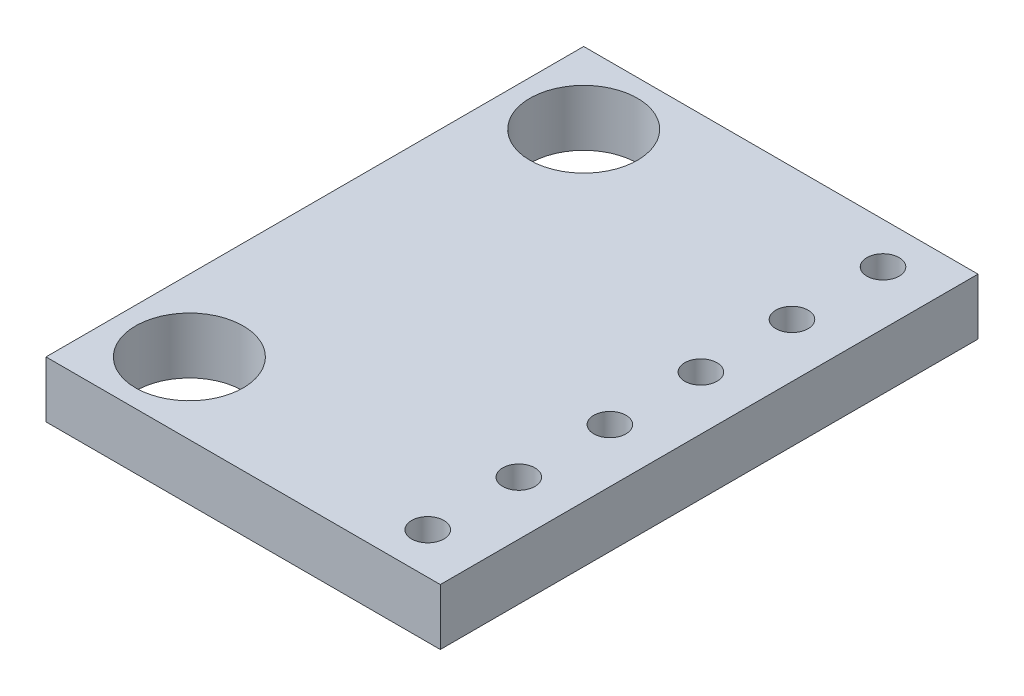
ISO-10303-21;
HEADER;
FILE_DESCRIPTION(('STEP AP214'),'2;1');
FILE_NAME('part.step','',(''),(''),'','','');
FILE_SCHEMA(('AUTOMOTIVE_DESIGN { 1 0 10303 214 1 1 1 1 }'));
ENDSEC;
DATA;
#1=APPLICATION_CONTEXT('core data for automotive mechanical design processes');
#2=APPLICATION_PROTOCOL_DEFINITION('international standard','automotive_design',2000,#1);
#3=PRODUCT_CONTEXT('',#1,'mechanical');
#4=PRODUCT('Part','Part','',(#3));
#5=PRODUCT_RELATED_PRODUCT_CATEGORY('part','',(#4));
#6=PRODUCT_DEFINITION_FORMATION('','',#4);
#7=PRODUCT_DEFINITION_CONTEXT('part definition',#1,'design');
#8=PRODUCT_DEFINITION('design','',#6,#7);
#9=PRODUCT_DEFINITION_SHAPE('','',#8);
#10=(LENGTH_UNIT() NAMED_UNIT(*) SI_UNIT(.MILLI.,.METRE.));
#11=(NAMED_UNIT(*) PLANE_ANGLE_UNIT() SI_UNIT($,.RADIAN.));
#12=(NAMED_UNIT(*) SI_UNIT($,.STERADIAN.) SOLID_ANGLE_UNIT());
#13=UNCERTAINTY_MEASURE_WITH_UNIT(LENGTH_MEASURE(1.E-05),#10,'distance_accuracy_value','');
#14=(GEOMETRIC_REPRESENTATION_CONTEXT(3) GLOBAL_UNCERTAINTY_ASSIGNED_CONTEXT((#13)) GLOBAL_UNIT_ASSIGNED_CONTEXT((#10,
#11,#12)) REPRESENTATION_CONTEXT('',''));
#15=CARTESIAN_POINT('',(0.,0.,0.));
#16=DIRECTION('',(0.,0.,1.));
#17=DIRECTION('',(1.,0.,0.));
#18=AXIS2_PLACEMENT_3D('',#15,#16,#17);
#19=CARTESIAN_POINT('',(-3.827710128787,-24.43241513081,3.399162858095));
#20=DIRECTION('',(0.,1.,0.));
#21=DIRECTION('',(0.,0.,1.));
#22=AXIS2_PLACEMENT_3D('',#19,#20,#21);
#23=PLANE('',#22);
#24=CARTESIAN_POINT('',(0.172289871213,-24.43241513081,9.749162858095));
#25=DIRECTION('',(0.,1.,0.));
#26=DIRECTION('',(0.,0.,1.));
#27=AXIS2_PLACEMENT_3D('',#24,#25,#26);
#28=CIRCLE('',#27,0.45);
#29=CARTESIAN_POINT('',(0.172289871213,-24.43241513081,10.199162858095));
#30=VERTEX_POINT('',#29);
#31=EDGE_CURVE('E103',#30,#30,#28,.T.);
#32=ORIENTED_EDGE('',*,*,#31,.T.);
#33=EDGE_LOOP('',(#32));
#34=FACE_BOUND('',#33,.T.);
#35=CARTESIAN_POINT('',(0.172289871213,-24.43241513081,7.209162858095));
#36=DIRECTION('',(0.,1.,0.));
#37=DIRECTION('',(0.,0.,1.));
#38=AXIS2_PLACEMENT_3D('',#35,#36,#37);
#39=CIRCLE('',#38,0.45);
#40=CARTESIAN_POINT('',(0.172289871213,-24.43241513081,7.659162858095));
#41=VERTEX_POINT('',#40);
#42=EDGE_CURVE('E107',#41,#41,#39,.T.);
#43=ORIENTED_EDGE('',*,*,#42,.T.);
#44=EDGE_LOOP('',(#43));
#45=FACE_BOUND('',#44,.T.);
#46=CARTESIAN_POINT('',(0.172289871213,-24.43241513081,4.669162858095));
#47=DIRECTION('',(0.,1.,0.));
#48=DIRECTION('',(0.,0.,1.));
#49=AXIS2_PLACEMENT_3D('',#46,#47,#48);
#50=CIRCLE('',#49,0.45);
#51=CARTESIAN_POINT('',(0.172289871213,-24.43241513081,5.119162858095));
#52=VERTEX_POINT('',#51);
#53=EDGE_CURVE('E110',#52,#52,#50,.T.);
#54=ORIENTED_EDGE('',*,*,#53,.T.);
#55=EDGE_LOOP('',(#54));
#56=FACE_BOUND('',#55,.T.);
#57=CARTESIAN_POINT('',(0.172289871213,-24.43241513081,2.129162858095));
#58=DIRECTION('',(0.,1.,0.));
#59=DIRECTION('',(0.,0.,1.));
#60=AXIS2_PLACEMENT_3D('',#57,#58,#59);
#61=CIRCLE('',#60,0.45);
#62=CARTESIAN_POINT('',(0.172289871213,-24.43241513081,2.579162858095));
#63=VERTEX_POINT('',#62);
#64=EDGE_CURVE('E113',#63,#63,#61,.T.);
#65=ORIENTED_EDGE('',*,*,#64,.T.);
#66=EDGE_LOOP('',(#65));
#67=FACE_BOUND('',#66,.T.);
#68=CARTESIAN_POINT('',(0.172289871213,-24.43241513081,-0.410837141905));
#69=DIRECTION('',(0.,1.,0.));
#70=DIRECTION('',(0.,0.,1.));
#71=AXIS2_PLACEMENT_3D('',#68,#69,#70);
#72=CIRCLE('',#71,0.45);
#73=CARTESIAN_POINT('',(0.172289871213,-24.43241513081,0.039162858095));
#74=VERTEX_POINT('',#73);
#75=EDGE_CURVE('E116',#74,#74,#72,.T.);
#76=ORIENTED_EDGE('',*,*,#75,.T.);
#77=EDGE_LOOP('',(#76));
#78=FACE_BOUND('',#77,.T.);
#79=CARTESIAN_POINT('',(0.172289871213,-24.43241513081,-2.950837141905));
#80=DIRECTION('',(0.,1.,0.));
#81=DIRECTION('',(0.,0.,1.));
#82=AXIS2_PLACEMENT_3D('',#79,#80,#81);
#83=CIRCLE('',#82,0.45);
#84=CARTESIAN_POINT('',(0.172289871213,-24.43241513081,-2.500837141905));
#85=VERTEX_POINT('',#84);
#86=EDGE_CURVE('E119',#85,#85,#83,.T.);
#87=ORIENTED_EDGE('',*,*,#86,.T.);
#88=EDGE_LOOP('',(#87));
#89=FACE_BOUND('',#88,.T.);
#90=CARTESIAN_POINT('',(-7.327710128787,-24.43241513081,8.899162858095));
#91=DIRECTION('',(0.,1.,0.));
#92=DIRECTION('',(0.,0.,1.));
#93=AXIS2_PLACEMENT_3D('',#90,#91,#92);
#94=CIRCLE('',#93,1.5);
#95=CARTESIAN_POINT('',(-7.327710128787,-24.43241513081,10.399162858095));
#96=VERTEX_POINT('',#95);
#97=EDGE_CURVE('E121',#96,#96,#94,.T.);
#98=ORIENTED_EDGE('',*,*,#97,.T.);
#99=EDGE_LOOP('',(#98));
#100=FACE_BOUND('',#99,.T.);
#101=CARTESIAN_POINT('',(-7.327710128787,-24.43241513081,-2.100837141905));
#102=DIRECTION('',(0.,1.,0.));
#103=DIRECTION('',(0.,0.,1.));
#104=AXIS2_PLACEMENT_3D('',#101,#102,#103);
#105=CIRCLE('',#104,1.5);
#106=CARTESIAN_POINT('',(-7.327710128787,-24.43241513081,-0.600837141905));
#107=VERTEX_POINT('',#106);
#108=EDGE_CURVE('E20',#107,#107,#105,.T.);
#109=ORIENTED_EDGE('',*,*,#108,.T.);
#110=EDGE_LOOP('',(#109));
#111=FACE_BOUND('',#110,.T.);
#112=DIRECTION('',(0.,0.,1.));
#113=VECTOR('',#112,1.);
#114=CARTESIAN_POINT('',(-9.327710128787,-24.43241513081,-4.100837141905));
#115=LINE('',#114,#113);
#116=CARTESIAN_POINT('',(-9.327710128787,-24.43241513081,-4.100837141905));
#117=VERTEX_POINT('',#116);
#118=CARTESIAN_POINT('',(-9.32771012878701,-24.43241513081,10.899162858095));
#119=VERTEX_POINT('',#118);
#120=EDGE_CURVE('E130',#117,#119,#115,.T.);
#121=ORIENTED_EDGE('',*,*,#120,.F.);
#122=DIRECTION('',(-1.,0.,0.));
#123=VECTOR('',#122,1.);
#124=CARTESIAN_POINT('',(1.672289871213,-24.43241513081,-4.100837141905));
#125=LINE('',#124,#123);
#126=CARTESIAN_POINT('',(1.67228987121301,-24.43241513081,-4.100837141905));
#127=VERTEX_POINT('',#126);
#128=EDGE_CURVE('E55',#127,#117,#125,.T.);
#129=ORIENTED_EDGE('',*,*,#128,.F.);
#130=DIRECTION('',(0.,0.,-1.));
#131=VECTOR('',#130,1.);
#132=CARTESIAN_POINT('',(1.672289871213,-24.43241513081,10.899162858095));
#133=LINE('',#132,#131);
#134=CARTESIAN_POINT('',(1.672289871213,-24.43241513081,10.899162858095));
#135=VERTEX_POINT('',#134);
#136=EDGE_CURVE('E57',#135,#127,#133,.T.);
#137=ORIENTED_EDGE('',*,*,#136,.F.);
#138=DIRECTION('',(1.,0.,0.));
#139=VECTOR('',#138,1.);
#140=CARTESIAN_POINT('',(-9.327710128787,-24.43241513081,10.899162858095));
#141=LINE('',#140,#139);
#142=EDGE_CURVE('E59',#119,#135,#141,.T.);
#143=ORIENTED_EDGE('',*,*,#142,.F.);
#144=EDGE_LOOP('',(#121,#129,#137,#143));
#145=FACE_BOUND('',#144,.T.);
#146=ADVANCED_FACE('F17',(#34,#45,#56,#67,#78,#89,#100,#111,#145),#23,.F.);
#147=CARTESIAN_POINT('',(-9.327710128787,-24.43241513081,10.899162858095));
#148=DIRECTION('',(0.,0.,1.));
#149=DIRECTION('',(1.,0.,0.));
#150=AXIS2_PLACEMENT_3D('',#147,#148,#149);
#151=PLANE('',#150);
#152=DIRECTION('',(1.,0.,0.));
#153=VECTOR('',#152,1.);
#154=CARTESIAN_POINT('',(-3.827710128787,-22.86241513081,10.899162858095));
#155=LINE('',#154,#153);
#156=CARTESIAN_POINT('',(-9.32771012878701,-22.86241513081,10.899162858095));
#157=VERTEX_POINT('',#156);
#158=CARTESIAN_POINT('',(1.672289871213,-22.86241513081,10.899162858095));
#159=VERTEX_POINT('',#158);
#160=EDGE_CURVE('E106',#157,#159,#155,.T.);
#161=ORIENTED_EDGE('',*,*,#160,.F.);
#162=DIRECTION('',(0.,1.,0.));
#163=VECTOR('',#162,1.);
#164=CARTESIAN_POINT('',(-9.32771012878703,-24.43241513081,10.899162858095));
#165=LINE('',#164,#163);
#166=EDGE_CURVE('E70',#119,#157,#165,.T.);
#167=ORIENTED_EDGE('',*,*,#166,.F.);
#168=ORIENTED_EDGE('',*,*,#142,.T.);
#169=DIRECTION('',(0.,1.,0.));
#170=VECTOR('',#169,1.);
#171=CARTESIAN_POINT('',(1.672289871213,-24.43241513081,10.899162858095));
#172=LINE('',#171,#170);
#173=EDGE_CURVE('E64',#159,#135,#172,.F.);
#174=ORIENTED_EDGE('',*,*,#173,.F.);
#175=EDGE_LOOP('',(#161,#167,#168,#174));
#176=FACE_BOUND('',#175,.T.);
#177=ADVANCED_FACE('F67',(#176),#151,.T.);
#178=CARTESIAN_POINT('',(1.672289871213,-24.43241513081,10.899162858095));
#179=DIRECTION('',(1.,0.,0.));
#180=DIRECTION('',(0.,0.,-1.));
#181=AXIS2_PLACEMENT_3D('',#178,#179,#180);
#182=PLANE('',#181);
#183=DIRECTION('',(0.,0.,1.));
#184=VECTOR('',#183,1.);
#185=CARTESIAN_POINT('',(1.672289871213,-22.86241513081,3.399162858095));
#186=LINE('',#185,#184);
#187=CARTESIAN_POINT('',(1.67228987121301,-22.86241513081,-4.100837141905));
#188=VERTEX_POINT('',#187);
#189=EDGE_CURVE('E75',#159,#188,#186,.F.);
#190=ORIENTED_EDGE('',*,*,#189,.F.);
#191=ORIENTED_EDGE('',*,*,#173,.T.);
#192=ORIENTED_EDGE('',*,*,#136,.T.);
#193=DIRECTION('',(0.,1.,0.));
#194=VECTOR('',#193,1.);
#195=CARTESIAN_POINT('',(1.672289871213,-24.43241513081,-4.100837141905));
#196=LINE('',#195,#194);
#197=EDGE_CURVE('E78',#188,#127,#196,.F.);
#198=ORIENTED_EDGE('',*,*,#197,.F.);
#199=EDGE_LOOP('',(#190,#191,#192,#198));
#200=FACE_BOUND('',#199,.T.);
#201=ADVANCED_FACE('F73',(#200),#182,.T.);
#202=CARTESIAN_POINT('',(1.672289871213,-24.43241513081,-4.100837141905));
#203=DIRECTION('',(0.,0.,-1.));
#204=DIRECTION('',(-1.,0.,0.));
#205=AXIS2_PLACEMENT_3D('',#202,#203,#204);
#206=PLANE('',#205);
#207=DIRECTION('',(1.,0.,0.));
#208=VECTOR('',#207,1.);
#209=CARTESIAN_POINT('',(-3.827710128787,-22.86241513081,-4.100837141905));
#210=LINE('',#209,#208);
#211=CARTESIAN_POINT('',(-9.327710128787,-22.86241513081,-4.10083714190501));
#212=VERTEX_POINT('',#211);
#213=EDGE_CURVE('E137',#188,#212,#210,.F.);
#214=ORIENTED_EDGE('',*,*,#213,.F.);
#215=ORIENTED_EDGE('',*,*,#197,.T.);
#216=ORIENTED_EDGE('',*,*,#128,.T.);
#217=DIRECTION('',(0.,1.,0.));
#218=VECTOR('',#217,1.);
#219=CARTESIAN_POINT('',(-9.327710128787,-24.43241513081,-4.100837141905));
#220=LINE('',#219,#218);
#221=EDGE_CURVE('E35',#212,#117,#220,.F.);
#222=ORIENTED_EDGE('',*,*,#221,.F.);
#223=EDGE_LOOP('',(#214,#215,#216,#222));
#224=FACE_BOUND('',#223,.T.);
#225=ADVANCED_FACE('F135',(#224),#206,.T.);
#226=CARTESIAN_POINT('',(-9.327710128787,-24.43241513081,-4.100837141905));
#227=DIRECTION('',(-1.,0.,0.));
#228=DIRECTION('',(0.,0.,1.));
#229=AXIS2_PLACEMENT_3D('',#226,#227,#228);
#230=PLANE('',#229);
#231=DIRECTION('',(0.,0.,1.));
#232=VECTOR('',#231,1.);
#233=CARTESIAN_POINT('',(-9.327710128787,-22.86241513081,3.399162858095));
#234=LINE('',#233,#232);
#235=EDGE_CURVE('E102',#212,#157,#234,.T.);
#236=ORIENTED_EDGE('',*,*,#235,.F.);
#237=ORIENTED_EDGE('',*,*,#221,.T.);
#238=ORIENTED_EDGE('',*,*,#120,.T.);
#239=ORIENTED_EDGE('',*,*,#166,.T.);
#240=EDGE_LOOP('',(#236,#237,#238,#239));
#241=FACE_BOUND('',#240,.T.);
#242=ADVANCED_FACE('F143',(#241),#230,.T.);
#243=CARTESIAN_POINT('',(-7.327710128787,-24.43241513081,-2.100837141905));
#244=DIRECTION('',(0.,1.,0.));
#245=DIRECTION('',(0.,0.,1.));
#246=AXIS2_PLACEMENT_3D('',#243,#244,#245);
#247=CYLINDRICAL_SURFACE('',#246,1.5);
#248=ORIENTED_EDGE('',*,*,#108,.F.);
#249=EDGE_LOOP('',(#248));
#250=FACE_BOUND('',#249,.T.);
#251=CARTESIAN_POINT('',(-7.327710128787,-22.86241513081,-2.100837141905));
#252=DIRECTION('',(0.,1.,0.));
#253=DIRECTION('',(0.,0.,1.));
#254=AXIS2_PLACEMENT_3D('',#251,#252,#253);
#255=CIRCLE('',#254,1.5);
#256=CARTESIAN_POINT('',(-7.327710128787,-22.86241513081,-0.600837141904999));
#257=VERTEX_POINT('',#256);
#258=EDGE_CURVE('E99',#257,#257,#255,.F.);
#259=ORIENTED_EDGE('',*,*,#258,.F.);
#260=EDGE_LOOP('',(#259));
#261=FACE_BOUND('',#260,.T.);
#262=ADVANCED_FACE('F145',(#250,#261),#247,.F.);
#263=CARTESIAN_POINT('',(-7.327710128787,-24.43241513081,8.899162858095));
#264=DIRECTION('',(0.,1.,0.));
#265=DIRECTION('',(0.,0.,1.));
#266=AXIS2_PLACEMENT_3D('',#263,#264,#265);
#267=CYLINDRICAL_SURFACE('',#266,1.5);
#268=ORIENTED_EDGE('',*,*,#97,.F.);
#269=EDGE_LOOP('',(#268));
#270=FACE_BOUND('',#269,.T.);
#271=CARTESIAN_POINT('',(-7.327710128787,-22.86241513081,8.899162858095));
#272=DIRECTION('',(0.,1.,0.));
#273=DIRECTION('',(0.,0.,1.));
#274=AXIS2_PLACEMENT_3D('',#271,#272,#273);
#275=CIRCLE('',#274,1.5);
#276=CARTESIAN_POINT('',(-7.327710128787,-22.86241513081,10.399162858095));
#277=VERTEX_POINT('',#276);
#278=EDGE_CURVE('E96',#277,#277,#275,.F.);
#279=ORIENTED_EDGE('',*,*,#278,.F.);
#280=EDGE_LOOP('',(#279));
#281=FACE_BOUND('',#280,.T.);
#282=ADVANCED_FACE('F152',(#270,#281),#267,.F.);
#283=CARTESIAN_POINT('',(0.172289871213,-24.43241513081,-2.950837141905));
#284=DIRECTION('',(0.,1.,0.));
#285=DIRECTION('',(0.,0.,1.));
#286=AXIS2_PLACEMENT_3D('',#283,#284,#285);
#287=CYLINDRICAL_SURFACE('',#286,0.45);
#288=ORIENTED_EDGE('',*,*,#86,.F.);
#289=EDGE_LOOP('',(#288));
#290=FACE_BOUND('',#289,.T.);
#291=CARTESIAN_POINT('',(0.172289871213,-22.86241513081,-2.950837141905));
#292=DIRECTION('',(0.,1.,0.));
#293=DIRECTION('',(0.,0.,1.));
#294=AXIS2_PLACEMENT_3D('',#291,#292,#293);
#295=CIRCLE('',#294,0.45);
#296=CARTESIAN_POINT('',(0.172289871213,-22.86241513081,-2.500837141905));
#297=VERTEX_POINT('',#296);
#298=EDGE_CURVE('E93',#297,#297,#295,.F.);
#299=ORIENTED_EDGE('',*,*,#298,.F.);
#300=EDGE_LOOP('',(#299));
#301=FACE_BOUND('',#300,.T.);
#302=ADVANCED_FACE('F182',(#290,#301),#287,.F.);
#303=CARTESIAN_POINT('',(0.172289871213,-24.43241513081,-0.410837141905));
#304=DIRECTION('',(0.,1.,0.));
#305=DIRECTION('',(0.,0.,1.));
#306=AXIS2_PLACEMENT_3D('',#303,#304,#305);
#307=CYLINDRICAL_SURFACE('',#306,0.45);
#308=ORIENTED_EDGE('',*,*,#75,.F.);
#309=EDGE_LOOP('',(#308));
#310=FACE_BOUND('',#309,.T.);
#311=CARTESIAN_POINT('',(0.172289871213,-22.86241513081,-0.410837141904999));
#312=DIRECTION('',(0.,1.,0.));
#313=DIRECTION('',(0.,0.,1.));
#314=AXIS2_PLACEMENT_3D('',#311,#312,#313);
#315=CIRCLE('',#314,0.45);
#316=CARTESIAN_POINT('',(0.172289871213,-22.86241513081,0.0391628580950014));
#317=VERTEX_POINT('',#316);
#318=EDGE_CURVE('E90',#317,#317,#315,.F.);
#319=ORIENTED_EDGE('',*,*,#318,.F.);
#320=EDGE_LOOP('',(#319));
#321=FACE_BOUND('',#320,.T.);
#322=ADVANCED_FACE('F178',(#310,#321),#307,.F.);
#323=CARTESIAN_POINT('',(0.172289871213,-24.43241513081,2.129162858095));
#324=DIRECTION('',(0.,1.,0.));
#325=DIRECTION('',(0.,0.,1.));
#326=AXIS2_PLACEMENT_3D('',#323,#324,#325);
#327=CYLINDRICAL_SURFACE('',#326,0.45);
#328=ORIENTED_EDGE('',*,*,#64,.F.);
#329=EDGE_LOOP('',(#328));
#330=FACE_BOUND('',#329,.T.);
#331=CARTESIAN_POINT('',(0.172289871213,-22.86241513081,2.129162858095));
#332=DIRECTION('',(0.,1.,0.));
#333=DIRECTION('',(0.,0.,1.));
#334=AXIS2_PLACEMENT_3D('',#331,#332,#333);
#335=CIRCLE('',#334,0.45);
#336=CARTESIAN_POINT('',(0.172289871213,-22.86241513081,2.579162858095));
#337=VERTEX_POINT('',#336);
#338=EDGE_CURVE('E87',#337,#337,#335,.F.);
#339=ORIENTED_EDGE('',*,*,#338,.F.);
#340=EDGE_LOOP('',(#339));
#341=FACE_BOUND('',#340,.T.);
#342=ADVANCED_FACE('F174',(#330,#341),#327,.F.);
#343=CARTESIAN_POINT('',(0.172289871213,-24.43241513081,4.669162858095));
#344=DIRECTION('',(0.,1.,0.));
#345=DIRECTION('',(0.,0.,1.));
#346=AXIS2_PLACEMENT_3D('',#343,#344,#345);
#347=CYLINDRICAL_SURFACE('',#346,0.45);
#348=ORIENTED_EDGE('',*,*,#53,.F.);
#349=EDGE_LOOP('',(#348));
#350=FACE_BOUND('',#349,.T.);
#351=CARTESIAN_POINT('',(0.172289871213,-22.86241513081,4.669162858095));
#352=DIRECTION('',(0.,1.,0.));
#353=DIRECTION('',(0.,0.,1.));
#354=AXIS2_PLACEMENT_3D('',#351,#352,#353);
#355=CIRCLE('',#354,0.45);
#356=CARTESIAN_POINT('',(0.172289871213,-22.86241513081,5.119162858095));
#357=VERTEX_POINT('',#356);
#358=EDGE_CURVE('E84',#357,#357,#355,.F.);
#359=ORIENTED_EDGE('',*,*,#358,.F.);
#360=EDGE_LOOP('',(#359));
#361=FACE_BOUND('',#360,.T.);
#362=ADVANCED_FACE('F170',(#350,#361),#347,.F.);
#363=CARTESIAN_POINT('',(0.172289871213,-24.43241513081,7.209162858095));
#364=DIRECTION('',(0.,1.,0.));
#365=DIRECTION('',(0.,0.,1.));
#366=AXIS2_PLACEMENT_3D('',#363,#364,#365);
#367=CYLINDRICAL_SURFACE('',#366,0.45);
#368=ORIENTED_EDGE('',*,*,#42,.F.);
#369=EDGE_LOOP('',(#368));
#370=FACE_BOUND('',#369,.T.);
#371=CARTESIAN_POINT('',(0.172289871213,-22.86241513081,7.209162858095));
#372=DIRECTION('',(0.,1.,0.));
#373=DIRECTION('',(0.,0.,1.));
#374=AXIS2_PLACEMENT_3D('',#371,#372,#373);
#375=CIRCLE('',#374,0.45);
#376=CARTESIAN_POINT('',(0.172289871213,-22.86241513081,7.659162858095));
#377=VERTEX_POINT('',#376);
#378=EDGE_CURVE('E26',#377,#377,#375,.F.);
#379=ORIENTED_EDGE('',*,*,#378,.F.);
#380=EDGE_LOOP('',(#379));
#381=FACE_BOUND('',#380,.T.);
#382=ADVANCED_FACE('F163',(#370,#381),#367,.F.);
#383=CARTESIAN_POINT('',(0.172289871213,-24.43241513081,9.749162858095));
#384=DIRECTION('',(0.,1.,0.));
#385=DIRECTION('',(0.,0.,1.));
#386=AXIS2_PLACEMENT_3D('',#383,#384,#385);
#387=CYLINDRICAL_SURFACE('',#386,0.45);
#388=ORIENTED_EDGE('',*,*,#31,.F.);
#389=EDGE_LOOP('',(#388));
#390=FACE_BOUND('',#389,.T.);
#391=CARTESIAN_POINT('',(0.172289871213,-22.86241513081,9.749162858095));
#392=DIRECTION('',(0.,1.,0.));
#393=DIRECTION('',(0.,0.,1.));
#394=AXIS2_PLACEMENT_3D('',#391,#392,#393);
#395=CIRCLE('',#394,0.45);
#396=CARTESIAN_POINT('',(0.172289871213,-22.86241513081,10.199162858095));
#397=VERTEX_POINT('',#396);
#398=EDGE_CURVE('E11',#397,#397,#395,.F.);
#399=ORIENTED_EDGE('',*,*,#398,.F.);
#400=EDGE_LOOP('',(#399));
#401=FACE_BOUND('',#400,.T.);
#402=ADVANCED_FACE('F157',(#390,#401),#387,.F.);
#403=CARTESIAN_POINT('',(-3.827710128787,-22.86241513081,3.399162858095));
#404=DIRECTION('',(0.,1.,0.));
#405=DIRECTION('',(0.,0.,1.));
#406=AXIS2_PLACEMENT_3D('',#403,#404,#405);
#407=PLANE('',#406);
#408=ORIENTED_EDGE('',*,*,#398,.T.);
#409=EDGE_LOOP('',(#408));
#410=FACE_BOUND('',#409,.T.);
#411=ORIENTED_EDGE('',*,*,#378,.T.);
#412=EDGE_LOOP('',(#411));
#413=FACE_BOUND('',#412,.T.);
#414=ORIENTED_EDGE('',*,*,#358,.T.);
#415=EDGE_LOOP('',(#414));
#416=FACE_BOUND('',#415,.T.);
#417=ORIENTED_EDGE('',*,*,#338,.T.);
#418=EDGE_LOOP('',(#417));
#419=FACE_BOUND('',#418,.T.);
#420=ORIENTED_EDGE('',*,*,#318,.T.);
#421=EDGE_LOOP('',(#420));
#422=FACE_BOUND('',#421,.T.);
#423=ORIENTED_EDGE('',*,*,#298,.T.);
#424=EDGE_LOOP('',(#423));
#425=FACE_BOUND('',#424,.T.);
#426=ORIENTED_EDGE('',*,*,#278,.T.);
#427=EDGE_LOOP('',(#426));
#428=FACE_BOUND('',#427,.T.);
#429=ORIENTED_EDGE('',*,*,#258,.T.);
#430=EDGE_LOOP('',(#429));
#431=FACE_BOUND('',#430,.T.);
#432=ORIENTED_EDGE('',*,*,#213,.T.);
#433=ORIENTED_EDGE('',*,*,#235,.T.);
#434=ORIENTED_EDGE('',*,*,#160,.T.);
#435=ORIENTED_EDGE('',*,*,#189,.T.);
#436=EDGE_LOOP('',(#432,#433,#434,#435));
#437=FACE_BOUND('',#436,.T.);
#438=ADVANCED_FACE('F141',(#410,#413,#416,#419,#422,#425,#428,#431,#437),#407,.T.);
#439=CLOSED_SHELL('',(#146,#177,#201,#225,#242,#262,#282,#302,#322,#342,#362,#382,#402,#438));
#440=MANIFOLD_SOLID_BREP('B1',#439);
#441=ADVANCED_BREP_SHAPE_REPRESENTATION('',(#18,#440),#14);
#442=SHAPE_DEFINITION_REPRESENTATION(#9,#441);
ENDSEC;
END-ISO-10303-21;
